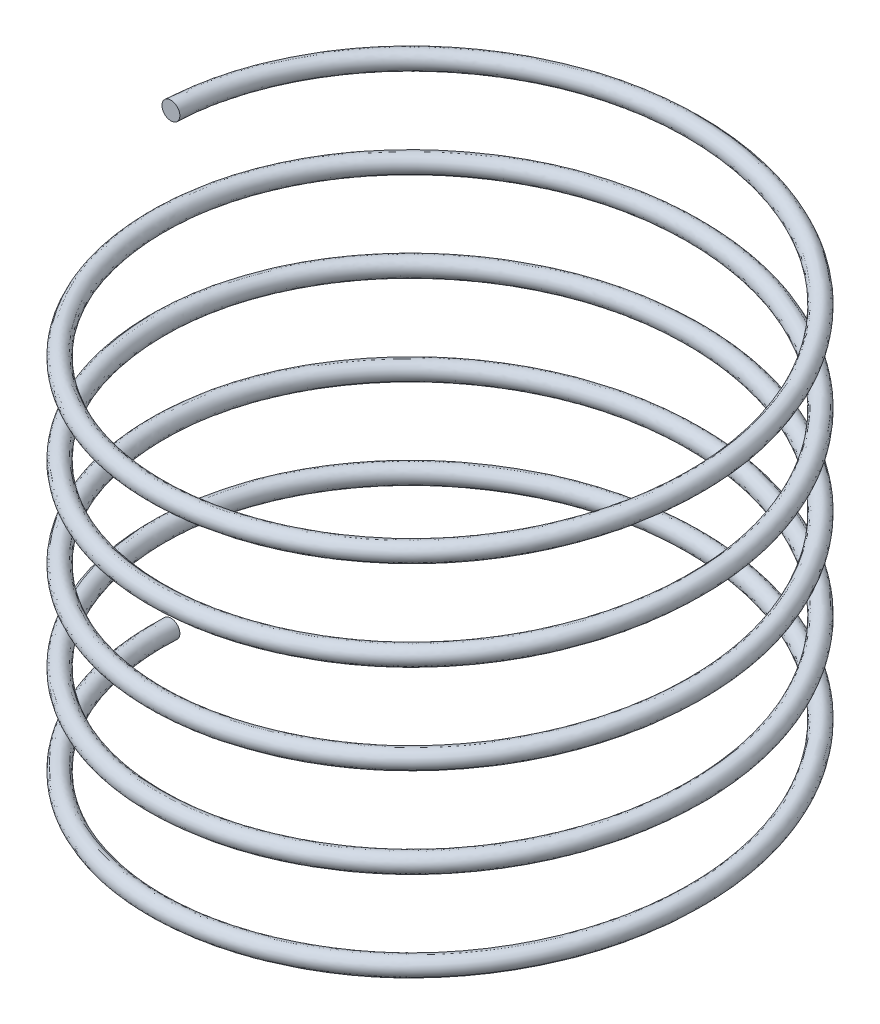
ISO-10303-21;
HEADER;
FILE_DESCRIPTION(('STEP AP214'),'2;1');
FILE_NAME('part.step','',(''),(''),'','','');
FILE_SCHEMA(('AUTOMOTIVE_DESIGN { 1 0 10303 214 1 1 1 1 }'));
ENDSEC;
DATA;
#1=APPLICATION_CONTEXT('core data for automotive mechanical design processes');
#2=APPLICATION_PROTOCOL_DEFINITION('international standard','automotive_design',2000,#1);
#3=PRODUCT_CONTEXT('',#1,'mechanical');
#4=PRODUCT('Part','Part','',(#3));
#5=PRODUCT_RELATED_PRODUCT_CATEGORY('part','',(#4));
#6=PRODUCT_DEFINITION_FORMATION('','',#4);
#7=PRODUCT_DEFINITION_CONTEXT('part definition',#1,'design');
#8=PRODUCT_DEFINITION('design','',#6,#7);
#9=PRODUCT_DEFINITION_SHAPE('','',#8);
#10=(LENGTH_UNIT() NAMED_UNIT(*) SI_UNIT(.MILLI.,.METRE.));
#11=(NAMED_UNIT(*) PLANE_ANGLE_UNIT() SI_UNIT($,.RADIAN.));
#12=(NAMED_UNIT(*) SI_UNIT($,.STERADIAN.) SOLID_ANGLE_UNIT());
#13=UNCERTAINTY_MEASURE_WITH_UNIT(LENGTH_MEASURE(1.E-05),#10,'distance_accuracy_value','');
#14=(GEOMETRIC_REPRESENTATION_CONTEXT(3) GLOBAL_UNCERTAINTY_ASSIGNED_CONTEXT((#13)) GLOBAL_UNIT_ASSIGNED_CONTEXT((#10,
#11,#12)) REPRESENTATION_CONTEXT('',''));
#15=CARTESIAN_POINT('',(0.,0.,0.));
#16=DIRECTION('',(0.,0.,1.));
#17=DIRECTION('',(1.,0.,0.));
#18=AXIS2_PLACEMENT_3D('',#15,#16,#17);
#19=CARTESIAN_POINT('',(-3.,0.,0.));
#20=DIRECTION('',(0.,0.,1.));
#21=DIRECTION('',(1.,0.,0.));
#22=AXIS2_PLACEMENT_3D('',#19,#20,#21);
#23=PLANE('',#22);
#24=CARTESIAN_POINT('',(-3.,0.,0.));
#25=DIRECTION('',(0.,0.,1.));
#26=DIRECTION('',(1.,0.,0.));
#27=AXIS2_PLACEMENT_3D('',#24,#25,#26);
#28=CIRCLE('',#27,0.0999999999999999);
#29=CARTESIAN_POINT('',(-2.9,0.,0.));
#30=VERTEX_POINT('',#29);
#31=EDGE_CURVE('E39',#30,#30,#28,.T.);
#32=ORIENTED_EDGE('',*,*,#31,.F.);
#33=EDGE_LOOP('',(#32));
#34=FACE_BOUND('',#33,.T.);
#35=ADVANCED_FACE('F32',(#34),#23,.F.);
#36=CARTESIAN_POINT('',(-3.,5.,2.09488880330588E-13));
#37=DIRECTION('',(0.,0.,1.));
#38=DIRECTION('',(1.,0.,0.));
#39=AXIS2_PLACEMENT_3D('',#36,#37,#38);
#40=PLANE('',#39);
#41=CARTESIAN_POINT('',(-3.,5.,2.09488880330588E-13));
#42=DIRECTION('',(0.,0.,1.));
#43=DIRECTION('',(1.,0.,0.));
#44=AXIS2_PLACEMENT_3D('',#41,#42,#43);
#45=CIRCLE('',#44,0.0999999999999999);
#46=CARTESIAN_POINT('',(-2.9,5.,2.02505917652902E-13));
#47=VERTEX_POINT('',#46);
#48=EDGE_CURVE('E11',#47,#47,#45,.T.);
#49=ORIENTED_EDGE('',*,*,#48,.T.);
#50=EDGE_LOOP('',(#49));
#51=FACE_BOUND('',#50,.T.);
#52=ADVANCED_FACE('F46',(#51),#40,.T.);
#53=CARTESIAN_POINT('',(-2.9,0.,0.));
#54=CARTESIAN_POINT('',(-2.9,0.0833333333333331,1.67431578064991));
#55=CARTESIAN_POINT('',(-1.45,0.166666666666666,2.51147367097487));
#56=CARTESIAN_POINT('',(0.,0.249999999999999,3.34863156129983));
#57=CARTESIAN_POINT('',(1.45,0.333333333333333,2.51147367097487));
#58=CARTESIAN_POINT('',(2.9,0.416666666666666,1.67431578064992));
#59=CARTESIAN_POINT('',(2.9,0.499999999999999,0.));
#60=CARTESIAN_POINT('',(2.9,0.583333333333332,-1.67431578064991));
#61=CARTESIAN_POINT('',(1.45,0.666666666666665,-2.51147367097487));
#62=CARTESIAN_POINT('',(0.,0.749999999999998,-3.34863156129983));
#63=CARTESIAN_POINT('',(-1.45,0.833333333333331,-2.51147367097487));
#64=CARTESIAN_POINT('',(-2.9,0.916666666666665,-1.67431578064992));
#65=CARTESIAN_POINT('',(-2.9,0.999999999999998,0.));
#66=CARTESIAN_POINT('',(-2.9,1.08333333333333,1.67431578064991));
#67=CARTESIAN_POINT('',(-1.45,1.16666666666666,2.51147367097487));
#68=CARTESIAN_POINT('',(0.,1.25,3.34863156129983));
#69=CARTESIAN_POINT('',(1.45,1.33333333333333,2.51147367097487));
#70=CARTESIAN_POINT('',(2.9,1.41666666666666,1.67431578064992));
#71=CARTESIAN_POINT('',(2.9,1.5,0.));
#72=CARTESIAN_POINT('',(2.9,1.58333333333333,-1.67431578064991));
#73=CARTESIAN_POINT('',(1.45,1.66666666666666,-2.51147367097487));
#74=CARTESIAN_POINT('',(0.,1.75,-3.34863156129983));
#75=CARTESIAN_POINT('',(-1.45,1.83333333333333,-2.51147367097487));
#76=CARTESIAN_POINT('',(-2.9,1.91666666666666,-1.67431578064992));
#77=CARTESIAN_POINT('',(-2.9,2.,0.));
#78=CARTESIAN_POINT('',(-2.9,2.08333333333333,1.67431578064991));
#79=CARTESIAN_POINT('',(-1.45,2.16666666666666,2.51147367097487));
#80=CARTESIAN_POINT('',(0.,2.24999999999999,3.34863156129983));
#81=CARTESIAN_POINT('',(1.45,2.33333333333333,2.51147367097487));
#82=CARTESIAN_POINT('',(2.9,2.41666666666666,1.67431578064992));
#83=CARTESIAN_POINT('',(2.9,2.49999999999999,0.));
#84=CARTESIAN_POINT('',(2.9,2.58333333333333,-1.67431578064991));
#85=CARTESIAN_POINT('',(1.45,2.66666666666666,-2.51147367097487));
#86=CARTESIAN_POINT('',(0.,2.74999999999999,-3.34863156129983));
#87=CARTESIAN_POINT('',(-1.45,2.83333333333333,-2.51147367097487));
#88=CARTESIAN_POINT('',(-2.9,2.91666666666666,-1.67431578064992));
#89=CARTESIAN_POINT('',(-2.9,2.99999999999999,0.));
#90=CARTESIAN_POINT('',(-2.9,3.08333333333333,1.67431578064991));
#91=CARTESIAN_POINT('',(-1.45,3.16666666666666,2.51147367097487));
#92=CARTESIAN_POINT('',(0.,3.24999999999999,3.34863156129983));
#93=CARTESIAN_POINT('',(1.45,3.33333333333333,2.51147367097487));
#94=CARTESIAN_POINT('',(2.9,3.41666666666666,1.67431578064992));
#95=CARTESIAN_POINT('',(2.9,3.49999999999999,0.));
#96=CARTESIAN_POINT('',(2.9,3.58333333333333,-1.67431578064991));
#97=CARTESIAN_POINT('',(1.45,3.66666666666666,-2.51147367097487));
#98=CARTESIAN_POINT('',(0.,3.74999999999999,-3.34863156129983));
#99=CARTESIAN_POINT('',(-1.45,3.83333333333332,-2.51147367097487));
#100=CARTESIAN_POINT('',(-2.9,3.91666666666666,-1.67431578064992));
#101=CARTESIAN_POINT('',(-2.9,3.99999999999999,0.));
#102=CARTESIAN_POINT('',(-2.9,4.08333333333332,1.67431578064991));
#103=CARTESIAN_POINT('',(-1.45,4.16666666666666,2.51147367097487));
#104=CARTESIAN_POINT('',(0.,4.24999999999999,3.34863156129983));
#105=CARTESIAN_POINT('',(1.45,4.33333333333332,2.51147367097487));
#106=CARTESIAN_POINT('',(2.9,4.41666666666666,1.67431578064992));
#107=CARTESIAN_POINT('',(2.9,4.49999999999999,0.));
#108=CARTESIAN_POINT('',(2.9,4.58333333333332,-1.67431578064991));
#109=CARTESIAN_POINT('',(1.45,4.66666666666666,-2.51147367097487));
#110=CARTESIAN_POINT('',(0.,4.74999999999999,-3.34863156129983));
#111=CARTESIAN_POINT('',(-1.45,4.83333333333332,-2.51147367097487));
#112=CARTESIAN_POINT('',(-2.9,4.91666666666666,-1.67431578064992));
#113=CARTESIAN_POINT('',(-2.9,4.99999999999999,0.));
#114=CARTESIAN_POINT('',(-2.9,0.2,0.));
#115=CARTESIAN_POINT('',(-2.9,0.283333333333333,1.67431578064991));
#116=CARTESIAN_POINT('',(-1.45,0.366666666666666,2.51147367097487));
#117=CARTESIAN_POINT('',(0.,0.449999999999999,3.34863156129983));
#118=CARTESIAN_POINT('',(1.45,0.533333333333332,2.51147367097487));
#119=CARTESIAN_POINT('',(2.9,0.616666666666666,1.67431578064992));
#120=CARTESIAN_POINT('',(2.9,0.699999999999999,0.));
#121=CARTESIAN_POINT('',(2.9,0.783333333333332,-1.67431578064991));
#122=CARTESIAN_POINT('',(1.45,0.866666666666665,-2.51147367097487));
#123=CARTESIAN_POINT('',(0.,0.949999999999998,-3.34863156129983));
#124=CARTESIAN_POINT('',(-1.45,1.03333333333333,-2.51147367097487));
#125=CARTESIAN_POINT('',(-2.9,1.11666666666666,-1.67431578064992));
#126=CARTESIAN_POINT('',(-2.9,1.2,0.));
#127=CARTESIAN_POINT('',(-2.9,1.28333333333333,1.67431578064991));
#128=CARTESIAN_POINT('',(-1.45,1.36666666666666,2.51147367097487));
#129=CARTESIAN_POINT('',(0.,1.45,3.34863156129983));
#130=CARTESIAN_POINT('',(1.45,1.53333333333333,2.51147367097487));
#131=CARTESIAN_POINT('',(2.9,1.61666666666666,1.67431578064992));
#132=CARTESIAN_POINT('',(2.9,1.7,0.));
#133=CARTESIAN_POINT('',(2.9,1.78333333333333,-1.67431578064991));
#134=CARTESIAN_POINT('',(1.45,1.86666666666666,-2.51147367097487));
#135=CARTESIAN_POINT('',(0.,1.95,-3.34863156129983));
#136=CARTESIAN_POINT('',(-1.45,2.03333333333333,-2.51147367097487));
#137=CARTESIAN_POINT('',(-2.9,2.11666666666666,-1.67431578064992));
#138=CARTESIAN_POINT('',(-2.9,2.19999999999999,0.));
#139=CARTESIAN_POINT('',(-2.9,2.28333333333333,1.67431578064991));
#140=CARTESIAN_POINT('',(-1.45,2.36666666666666,2.51147367097487));
#141=CARTESIAN_POINT('',(0.,2.44999999999999,3.34863156129983));
#142=CARTESIAN_POINT('',(1.45,2.53333333333333,2.51147367097487));
#143=CARTESIAN_POINT('',(2.9,2.61666666666666,1.67431578064992));
#144=CARTESIAN_POINT('',(2.9,2.69999999999999,0.));
#145=CARTESIAN_POINT('',(2.9,2.78333333333333,-1.67431578064991));
#146=CARTESIAN_POINT('',(1.45,2.86666666666666,-2.51147367097487));
#147=CARTESIAN_POINT('',(0.,2.94999999999999,-3.34863156129983));
#148=CARTESIAN_POINT('',(-1.45,3.03333333333333,-2.51147367097487));
#149=CARTESIAN_POINT('',(-2.9,3.11666666666666,-1.67431578064992));
#150=CARTESIAN_POINT('',(-2.9,3.19999999999999,0.));
#151=CARTESIAN_POINT('',(-2.9,3.28333333333333,1.67431578064991));
#152=CARTESIAN_POINT('',(-1.45,3.36666666666666,2.51147367097487));
#153=CARTESIAN_POINT('',(0.,3.44999999999999,3.34863156129983));
#154=CARTESIAN_POINT('',(1.45,3.53333333333333,2.51147367097487));
#155=CARTESIAN_POINT('',(2.9,3.61666666666666,1.67431578064992));
#156=CARTESIAN_POINT('',(2.9,3.69999999999999,0.));
#157=CARTESIAN_POINT('',(2.9,3.78333333333333,-1.67431578064991));
#158=CARTESIAN_POINT('',(1.45,3.86666666666666,-2.51147367097487));
#159=CARTESIAN_POINT('',(0.,3.94999999999999,-3.34863156129983));
#160=CARTESIAN_POINT('',(-1.45,4.03333333333332,-2.51147367097487));
#161=CARTESIAN_POINT('',(-2.9,4.11666666666666,-1.67431578064992));
#162=CARTESIAN_POINT('',(-2.9,4.19999999999999,0.));
#163=CARTESIAN_POINT('',(-2.9,4.28333333333332,1.67431578064991));
#164=CARTESIAN_POINT('',(-1.45,4.36666666666666,2.51147367097487));
#165=CARTESIAN_POINT('',(0.,4.44999999999999,3.34863156129983));
#166=CARTESIAN_POINT('',(1.45,4.53333333333332,2.51147367097487));
#167=CARTESIAN_POINT('',(2.9,4.61666666666666,1.67431578064992));
#168=CARTESIAN_POINT('',(2.9,4.69999999999999,0.));
#169=CARTESIAN_POINT('',(2.9,4.78333333333332,-1.67431578064991));
#170=CARTESIAN_POINT('',(1.45,4.86666666666666,-2.51147367097487));
#171=CARTESIAN_POINT('',(0.,4.94999999999999,-3.34863156129983));
#172=CARTESIAN_POINT('',(-1.45,5.03333333333332,-2.51147367097487));
#173=CARTESIAN_POINT('',(-2.9,5.11666666666665,-1.67431578064992));
#174=CARTESIAN_POINT('',(-2.9,5.19999999999999,0.));
#175=CARTESIAN_POINT('',(-3.1,0.2,0.));
#176=CARTESIAN_POINT('',(-3.1,0.283333333333333,1.78978583448784));
#177=CARTESIAN_POINT('',(-1.55,0.366666666666666,2.68467875173176));
#178=CARTESIAN_POINT('',(0.,0.449999999999999,3.57957166897568));
#179=CARTESIAN_POINT('',(1.55,0.533333333333332,2.68467875173176));
#180=CARTESIAN_POINT('',(3.1,0.616666666666666,1.78978583448784));
#181=CARTESIAN_POINT('',(3.1,0.699999999999999,0.));
#182=CARTESIAN_POINT('',(3.1,0.783333333333332,-1.78978583448784));
#183=CARTESIAN_POINT('',(1.55,0.866666666666665,-2.68467875173176));
#184=CARTESIAN_POINT('',(0.,0.949999999999998,-3.57957166897568));
#185=CARTESIAN_POINT('',(-1.55,1.03333333333333,-2.68467875173176));
#186=CARTESIAN_POINT('',(-3.1,1.11666666666666,-1.78978583448784));
#187=CARTESIAN_POINT('',(-3.1,1.2,0.));
#188=CARTESIAN_POINT('',(-3.1,1.28333333333333,1.78978583448784));
#189=CARTESIAN_POINT('',(-1.55,1.36666666666666,2.68467875173176));
#190=CARTESIAN_POINT('',(0.,1.45,3.57957166897568));
#191=CARTESIAN_POINT('',(1.55,1.53333333333333,2.68467875173176));
#192=CARTESIAN_POINT('',(3.1,1.61666666666666,1.78978583448784));
#193=CARTESIAN_POINT('',(3.1,1.7,0.));
#194=CARTESIAN_POINT('',(3.1,1.78333333333333,-1.78978583448784));
#195=CARTESIAN_POINT('',(1.55,1.86666666666666,-2.68467875173176));
#196=CARTESIAN_POINT('',(0.,1.95,-3.57957166897568));
#197=CARTESIAN_POINT('',(-1.55,2.03333333333333,-2.68467875173176));
#198=CARTESIAN_POINT('',(-3.1,2.11666666666666,-1.78978583448784));
#199=CARTESIAN_POINT('',(-3.1,2.19999999999999,0.));
#200=CARTESIAN_POINT('',(-3.1,2.28333333333333,1.78978583448784));
#201=CARTESIAN_POINT('',(-1.55,2.36666666666666,2.68467875173176));
#202=CARTESIAN_POINT('',(0.,2.44999999999999,3.57957166897568));
#203=CARTESIAN_POINT('',(1.55,2.53333333333333,2.68467875173176));
#204=CARTESIAN_POINT('',(3.1,2.61666666666666,1.78978583448784));
#205=CARTESIAN_POINT('',(3.1,2.69999999999999,0.));
#206=CARTESIAN_POINT('',(3.1,2.78333333333333,-1.78978583448784));
#207=CARTESIAN_POINT('',(1.55,2.86666666666666,-2.68467875173176));
#208=CARTESIAN_POINT('',(0.,2.94999999999999,-3.57957166897568));
#209=CARTESIAN_POINT('',(-1.55,3.03333333333333,-2.68467875173176));
#210=CARTESIAN_POINT('',(-3.1,3.11666666666666,-1.78978583448784));
#211=CARTESIAN_POINT('',(-3.1,3.19999999999999,0.));
#212=CARTESIAN_POINT('',(-3.1,3.28333333333333,1.78978583448784));
#213=CARTESIAN_POINT('',(-1.55,3.36666666666666,2.68467875173176));
#214=CARTESIAN_POINT('',(0.,3.44999999999999,3.57957166897568));
#215=CARTESIAN_POINT('',(1.55,3.53333333333333,2.68467875173176));
#216=CARTESIAN_POINT('',(3.1,3.61666666666666,1.78978583448784));
#217=CARTESIAN_POINT('',(3.1,3.69999999999999,0.));
#218=CARTESIAN_POINT('',(3.1,3.78333333333333,-1.78978583448784));
#219=CARTESIAN_POINT('',(1.55,3.86666666666666,-2.68467875173176));
#220=CARTESIAN_POINT('',(0.,3.94999999999999,-3.57957166897568));
#221=CARTESIAN_POINT('',(-1.55,4.03333333333332,-2.68467875173176));
#222=CARTESIAN_POINT('',(-3.1,4.11666666666666,-1.78978583448784));
#223=CARTESIAN_POINT('',(-3.1,4.19999999999999,0.));
#224=CARTESIAN_POINT('',(-3.1,4.28333333333332,1.78978583448784));
#225=CARTESIAN_POINT('',(-1.55,4.36666666666666,2.68467875173176));
#226=CARTESIAN_POINT('',(0.,4.44999999999999,3.57957166897568));
#227=CARTESIAN_POINT('',(1.55,4.53333333333332,2.68467875173176));
#228=CARTESIAN_POINT('',(3.1,4.61666666666666,1.78978583448784));
#229=CARTESIAN_POINT('',(3.1,4.69999999999999,0.));
#230=CARTESIAN_POINT('',(3.1,4.78333333333332,-1.78978583448784));
#231=CARTESIAN_POINT('',(1.55,4.86666666666666,-2.68467875173176));
#232=CARTESIAN_POINT('',(0.,4.94999999999999,-3.57957166897568));
#233=CARTESIAN_POINT('',(-1.55,5.03333333333332,-2.68467875173176));
#234=CARTESIAN_POINT('',(-3.1,5.11666666666665,-1.78978583448784));
#235=CARTESIAN_POINT('',(-3.1,5.19999999999999,0.));
#236=CARTESIAN_POINT('',(-3.1,0.,0.));
#237=CARTESIAN_POINT('',(-3.1,0.0833333333333331,1.78978583448784));
#238=CARTESIAN_POINT('',(-1.55,0.166666666666666,2.68467875173176));
#239=CARTESIAN_POINT('',(0.,0.249999999999999,3.57957166897568));
#240=CARTESIAN_POINT('',(1.55,0.333333333333333,2.68467875173176));
#241=CARTESIAN_POINT('',(3.1,0.416666666666666,1.78978583448784));
#242=CARTESIAN_POINT('',(3.1,0.499999999999999,0.));
#243=CARTESIAN_POINT('',(3.1,0.583333333333332,-1.78978583448784));
#244=CARTESIAN_POINT('',(1.55,0.666666666666665,-2.68467875173176));
#245=CARTESIAN_POINT('',(0.,0.749999999999998,-3.57957166897568));
#246=CARTESIAN_POINT('',(-1.55,0.833333333333331,-2.68467875173176));
#247=CARTESIAN_POINT('',(-3.1,0.916666666666665,-1.78978583448784));
#248=CARTESIAN_POINT('',(-3.1,0.999999999999998,0.));
#249=CARTESIAN_POINT('',(-3.1,1.08333333333333,1.78978583448784));
#250=CARTESIAN_POINT('',(-1.55,1.16666666666666,2.68467875173176));
#251=CARTESIAN_POINT('',(0.,1.25,3.57957166897568));
#252=CARTESIAN_POINT('',(1.55,1.33333333333333,2.68467875173176));
#253=CARTESIAN_POINT('',(3.1,1.41666666666666,1.78978583448784));
#254=CARTESIAN_POINT('',(3.1,1.5,0.));
#255=CARTESIAN_POINT('',(3.1,1.58333333333333,-1.78978583448784));
#256=CARTESIAN_POINT('',(1.55,1.66666666666666,-2.68467875173176));
#257=CARTESIAN_POINT('',(0.,1.75,-3.57957166897568));
#258=CARTESIAN_POINT('',(-1.55,1.83333333333333,-2.68467875173176));
#259=CARTESIAN_POINT('',(-3.1,1.91666666666666,-1.78978583448784));
#260=CARTESIAN_POINT('',(-3.1,2.,0.));
#261=CARTESIAN_POINT('',(-3.1,2.08333333333333,1.78978583448784));
#262=CARTESIAN_POINT('',(-1.55,2.16666666666666,2.68467875173176));
#263=CARTESIAN_POINT('',(0.,2.24999999999999,3.57957166897568));
#264=CARTESIAN_POINT('',(1.55,2.33333333333333,2.68467875173176));
#265=CARTESIAN_POINT('',(3.1,2.41666666666666,1.78978583448784));
#266=CARTESIAN_POINT('',(3.1,2.49999999999999,0.));
#267=CARTESIAN_POINT('',(3.1,2.58333333333333,-1.78978583448784));
#268=CARTESIAN_POINT('',(1.55,2.66666666666666,-2.68467875173176));
#269=CARTESIAN_POINT('',(0.,2.74999999999999,-3.57957166897568));
#270=CARTESIAN_POINT('',(-1.55,2.83333333333333,-2.68467875173176));
#271=CARTESIAN_POINT('',(-3.1,2.91666666666666,-1.78978583448784));
#272=CARTESIAN_POINT('',(-3.1,2.99999999999999,0.));
#273=CARTESIAN_POINT('',(-3.1,3.08333333333333,1.78978583448784));
#274=CARTESIAN_POINT('',(-1.55,3.16666666666666,2.68467875173176));
#275=CARTESIAN_POINT('',(0.,3.24999999999999,3.57957166897568));
#276=CARTESIAN_POINT('',(1.55,3.33333333333333,2.68467875173176));
#277=CARTESIAN_POINT('',(3.1,3.41666666666666,1.78978583448784));
#278=CARTESIAN_POINT('',(3.1,3.49999999999999,0.));
#279=CARTESIAN_POINT('',(3.1,3.58333333333333,-1.78978583448784));
#280=CARTESIAN_POINT('',(1.55,3.66666666666666,-2.68467875173176));
#281=CARTESIAN_POINT('',(0.,3.74999999999999,-3.57957166897568));
#282=CARTESIAN_POINT('',(-1.55,3.83333333333332,-2.68467875173176));
#283=CARTESIAN_POINT('',(-3.1,3.91666666666666,-1.78978583448784));
#284=CARTESIAN_POINT('',(-3.1,3.99999999999999,0.));
#285=CARTESIAN_POINT('',(-3.1,4.08333333333332,1.78978583448784));
#286=CARTESIAN_POINT('',(-1.55,4.16666666666666,2.68467875173176));
#287=CARTESIAN_POINT('',(0.,4.24999999999999,3.57957166897568));
#288=CARTESIAN_POINT('',(1.55,4.33333333333332,2.68467875173176));
#289=CARTESIAN_POINT('',(3.1,4.41666666666666,1.78978583448784));
#290=CARTESIAN_POINT('',(3.1,4.49999999999999,0.));
#291=CARTESIAN_POINT('',(3.1,4.58333333333332,-1.78978583448784));
#292=CARTESIAN_POINT('',(1.55,4.66666666666666,-2.68467875173176));
#293=CARTESIAN_POINT('',(0.,4.74999999999999,-3.57957166897568));
#294=CARTESIAN_POINT('',(-1.55,4.83333333333332,-2.68467875173176));
#295=CARTESIAN_POINT('',(-3.1,4.91666666666666,-1.78978583448784));
#296=CARTESIAN_POINT('',(-3.1,4.99999999999999,0.));
#297=CARTESIAN_POINT('',(-3.1,-0.2,0.));
#298=CARTESIAN_POINT('',(-3.1,-0.116666666666667,1.78978583448784));
#299=CARTESIAN_POINT('',(-1.55,-0.0333333333333335,2.68467875173176));
#300=CARTESIAN_POINT('',(0.,0.0499999999999997,3.57957166897568));
#301=CARTESIAN_POINT('',(1.55,0.133333333333333,2.68467875173176));
#302=CARTESIAN_POINT('',(3.1,0.216666666666666,1.78978583448784));
#303=CARTESIAN_POINT('',(3.1,0.299999999999999,0.));
#304=CARTESIAN_POINT('',(3.1,0.383333333333332,-1.78978583448784));
#305=CARTESIAN_POINT('',(1.55,0.466666666666665,-2.68467875173176));
#306=CARTESIAN_POINT('',(0.,0.549999999999998,-3.57957166897568));
#307=CARTESIAN_POINT('',(-1.55,0.633333333333332,-2.68467875173176));
#308=CARTESIAN_POINT('',(-3.1,0.716666666666665,-1.78978583448784));
#309=CARTESIAN_POINT('',(-3.1,0.799999999999998,0.));
#310=CARTESIAN_POINT('',(-3.1,0.883333333333331,1.78978583448784));
#311=CARTESIAN_POINT('',(-1.55,0.966666666666664,2.68467875173176));
#312=CARTESIAN_POINT('',(0.,1.05,3.57957166897568));
#313=CARTESIAN_POINT('',(1.55,1.13333333333333,2.68467875173176));
#314=CARTESIAN_POINT('',(3.1,1.21666666666666,1.78978583448784));
#315=CARTESIAN_POINT('',(3.1,1.3,0.));
#316=CARTESIAN_POINT('',(3.1,1.38333333333333,-1.78978583448784));
#317=CARTESIAN_POINT('',(1.55,1.46666666666666,-2.68467875173176));
#318=CARTESIAN_POINT('',(0.,1.55,-3.57957166897568));
#319=CARTESIAN_POINT('',(-1.55,1.63333333333333,-2.68467875173176));
#320=CARTESIAN_POINT('',(-3.1,1.71666666666666,-1.78978583448784));
#321=CARTESIAN_POINT('',(-3.1,1.8,0.));
#322=CARTESIAN_POINT('',(-3.1,1.88333333333333,1.78978583448784));
#323=CARTESIAN_POINT('',(-1.55,1.96666666666666,2.68467875173176));
#324=CARTESIAN_POINT('',(0.,2.04999999999999,3.57957166897568));
#325=CARTESIAN_POINT('',(1.55,2.13333333333333,2.68467875173176));
#326=CARTESIAN_POINT('',(3.1,2.21666666666666,1.78978583448784));
#327=CARTESIAN_POINT('',(3.1,2.29999999999999,0.));
#328=CARTESIAN_POINT('',(3.1,2.38333333333333,-1.78978583448784));
#329=CARTESIAN_POINT('',(1.55,2.46666666666666,-2.68467875173176));
#330=CARTESIAN_POINT('',(0.,2.54999999999999,-3.57957166897568));
#331=CARTESIAN_POINT('',(-1.55,2.63333333333333,-2.68467875173176));
#332=CARTESIAN_POINT('',(-3.1,2.71666666666666,-1.78978583448784));
#333=CARTESIAN_POINT('',(-3.1,2.79999999999999,0.));
#334=CARTESIAN_POINT('',(-3.1,2.88333333333333,1.78978583448784));
#335=CARTESIAN_POINT('',(-1.55,2.96666666666666,2.68467875173176));
#336=CARTESIAN_POINT('',(0.,3.04999999999999,3.57957166897568));
#337=CARTESIAN_POINT('',(1.55,3.13333333333333,2.68467875173176));
#338=CARTESIAN_POINT('',(3.1,3.21666666666666,1.78978583448784));
#339=CARTESIAN_POINT('',(3.1,3.29999999999999,0.));
#340=CARTESIAN_POINT('',(3.1,3.38333333333333,-1.78978583448784));
#341=CARTESIAN_POINT('',(1.55,3.46666666666666,-2.68467875173176));
#342=CARTESIAN_POINT('',(0.,3.54999999999999,-3.57957166897568));
#343=CARTESIAN_POINT('',(-1.55,3.63333333333332,-2.68467875173176));
#344=CARTESIAN_POINT('',(-3.1,3.71666666666666,-1.78978583448784));
#345=CARTESIAN_POINT('',(-3.1,3.79999999999999,0.));
#346=CARTESIAN_POINT('',(-3.1,3.88333333333332,1.78978583448784));
#347=CARTESIAN_POINT('',(-1.55,3.96666666666666,2.68467875173176));
#348=CARTESIAN_POINT('',(0.,4.04999999999999,3.57957166897568));
#349=CARTESIAN_POINT('',(1.55,4.13333333333332,2.68467875173176));
#350=CARTESIAN_POINT('',(3.1,4.21666666666666,1.78978583448784));
#351=CARTESIAN_POINT('',(3.1,4.29999999999999,0.));
#352=CARTESIAN_POINT('',(3.1,4.38333333333332,-1.78978583448784));
#353=CARTESIAN_POINT('',(1.55,4.46666666666666,-2.68467875173176));
#354=CARTESIAN_POINT('',(0.,4.54999999999999,-3.57957166897568));
#355=CARTESIAN_POINT('',(-1.55,4.63333333333332,-2.68467875173176));
#356=CARTESIAN_POINT('',(-3.1,4.71666666666666,-1.78978583448784));
#357=CARTESIAN_POINT('',(-3.1,4.79999999999999,0.));
#358=CARTESIAN_POINT('',(-2.9,-0.2,0.));
#359=CARTESIAN_POINT('',(-2.9,-0.116666666666667,1.67431578064991));
#360=CARTESIAN_POINT('',(-1.45,-0.0333333333333335,2.51147367097487));
#361=CARTESIAN_POINT('',(0.,0.0499999999999997,3.34863156129983));
#362=CARTESIAN_POINT('',(1.45,0.133333333333333,2.51147367097487));
#363=CARTESIAN_POINT('',(2.9,0.216666666666666,1.67431578064992));
#364=CARTESIAN_POINT('',(2.9,0.299999999999999,0.));
#365=CARTESIAN_POINT('',(2.9,0.383333333333332,-1.67431578064991));
#366=CARTESIAN_POINT('',(1.45,0.466666666666665,-2.51147367097487));
#367=CARTESIAN_POINT('',(0.,0.549999999999998,-3.34863156129983));
#368=CARTESIAN_POINT('',(-1.45,0.633333333333332,-2.51147367097487));
#369=CARTESIAN_POINT('',(-2.9,0.716666666666665,-1.67431578064992));
#370=CARTESIAN_POINT('',(-2.9,0.799999999999998,0.));
#371=CARTESIAN_POINT('',(-2.9,0.883333333333331,1.67431578064991));
#372=CARTESIAN_POINT('',(-1.45,0.966666666666664,2.51147367097487));
#373=CARTESIAN_POINT('',(0.,1.05,3.34863156129983));
#374=CARTESIAN_POINT('',(1.45,1.13333333333333,2.51147367097487));
#375=CARTESIAN_POINT('',(2.9,1.21666666666666,1.67431578064992));
#376=CARTESIAN_POINT('',(2.9,1.3,0.));
#377=CARTESIAN_POINT('',(2.9,1.38333333333333,-1.67431578064991));
#378=CARTESIAN_POINT('',(1.45,1.46666666666666,-2.51147367097487));
#379=CARTESIAN_POINT('',(0.,1.55,-3.34863156129983));
#380=CARTESIAN_POINT('',(-1.45,1.63333333333333,-2.51147367097487));
#381=CARTESIAN_POINT('',(-2.9,1.71666666666666,-1.67431578064992));
#382=CARTESIAN_POINT('',(-2.9,1.8,0.));
#383=CARTESIAN_POINT('',(-2.9,1.88333333333333,1.67431578064991));
#384=CARTESIAN_POINT('',(-1.45,1.96666666666666,2.51147367097487));
#385=CARTESIAN_POINT('',(0.,2.04999999999999,3.34863156129983));
#386=CARTESIAN_POINT('',(1.45,2.13333333333333,2.51147367097487));
#387=CARTESIAN_POINT('',(2.9,2.21666666666666,1.67431578064992));
#388=CARTESIAN_POINT('',(2.9,2.29999999999999,0.));
#389=CARTESIAN_POINT('',(2.9,2.38333333333333,-1.67431578064991));
#390=CARTESIAN_POINT('',(1.45,2.46666666666666,-2.51147367097487));
#391=CARTESIAN_POINT('',(0.,2.54999999999999,-3.34863156129983));
#392=CARTESIAN_POINT('',(-1.45,2.63333333333333,-2.51147367097487));
#393=CARTESIAN_POINT('',(-2.9,2.71666666666666,-1.67431578064992));
#394=CARTESIAN_POINT('',(-2.9,2.79999999999999,0.));
#395=CARTESIAN_POINT('',(-2.9,2.88333333333333,1.67431578064991));
#396=CARTESIAN_POINT('',(-1.45,2.96666666666666,2.51147367097487));
#397=CARTESIAN_POINT('',(0.,3.04999999999999,3.34863156129983));
#398=CARTESIAN_POINT('',(1.45,3.13333333333333,2.51147367097487));
#399=CARTESIAN_POINT('',(2.9,3.21666666666666,1.67431578064992));
#400=CARTESIAN_POINT('',(2.9,3.29999999999999,0.));
#401=CARTESIAN_POINT('',(2.9,3.38333333333333,-1.67431578064991));
#402=CARTESIAN_POINT('',(1.45,3.46666666666666,-2.51147367097487));
#403=CARTESIAN_POINT('',(0.,3.54999999999999,-3.34863156129983));
#404=CARTESIAN_POINT('',(-1.45,3.63333333333332,-2.51147367097487));
#405=CARTESIAN_POINT('',(-2.9,3.71666666666666,-1.67431578064992));
#406=CARTESIAN_POINT('',(-2.9,3.79999999999999,0.));
#407=CARTESIAN_POINT('',(-2.9,3.88333333333332,1.67431578064991));
#408=CARTESIAN_POINT('',(-1.45,3.96666666666666,2.51147367097487));
#409=CARTESIAN_POINT('',(0.,4.04999999999999,3.34863156129983));
#410=CARTESIAN_POINT('',(1.45,4.13333333333332,2.51147367097487));
#411=CARTESIAN_POINT('',(2.9,4.21666666666666,1.67431578064992));
#412=CARTESIAN_POINT('',(2.9,4.29999999999999,0.));
#413=CARTESIAN_POINT('',(2.9,4.38333333333332,-1.67431578064991));
#414=CARTESIAN_POINT('',(1.45,4.46666666666666,-2.51147367097487));
#415=CARTESIAN_POINT('',(0.,4.54999999999999,-3.34863156129983));
#416=CARTESIAN_POINT('',(-1.45,4.63333333333332,-2.51147367097487));
#417=CARTESIAN_POINT('',(-2.9,4.71666666666666,-1.67431578064992));
#418=CARTESIAN_POINT('',(-2.9,4.79999999999999,0.));
#419=CARTESIAN_POINT('',(-2.9,0.,0.));
#420=CARTESIAN_POINT('',(-2.9,0.0833333333333331,1.67431578064991));
#421=CARTESIAN_POINT('',(-1.45,0.166666666666666,2.51147367097487));
#422=CARTESIAN_POINT('',(0.,0.249999999999999,3.34863156129983));
#423=CARTESIAN_POINT('',(1.45,0.333333333333333,2.51147367097487));
#424=CARTESIAN_POINT('',(2.9,0.416666666666666,1.67431578064992));
#425=CARTESIAN_POINT('',(2.9,0.499999999999999,0.));
#426=CARTESIAN_POINT('',(2.9,0.583333333333332,-1.67431578064991));
#427=CARTESIAN_POINT('',(1.45,0.666666666666665,-2.51147367097487));
#428=CARTESIAN_POINT('',(0.,0.749999999999998,-3.34863156129983));
#429=CARTESIAN_POINT('',(-1.45,0.833333333333331,-2.51147367097487));
#430=CARTESIAN_POINT('',(-2.9,0.916666666666665,-1.67431578064992));
#431=CARTESIAN_POINT('',(-2.9,0.999999999999998,0.));
#432=CARTESIAN_POINT('',(-2.9,1.08333333333333,1.67431578064991));
#433=CARTESIAN_POINT('',(-1.45,1.16666666666666,2.51147367097487));
#434=CARTESIAN_POINT('',(0.,1.25,3.34863156129983));
#435=CARTESIAN_POINT('',(1.45,1.33333333333333,2.51147367097487));
#436=CARTESIAN_POINT('',(2.9,1.41666666666666,1.67431578064992));
#437=CARTESIAN_POINT('',(2.9,1.5,0.));
#438=CARTESIAN_POINT('',(2.9,1.58333333333333,-1.67431578064991));
#439=CARTESIAN_POINT('',(1.45,1.66666666666666,-2.51147367097487));
#440=CARTESIAN_POINT('',(0.,1.75,-3.34863156129983));
#441=CARTESIAN_POINT('',(-1.45,1.83333333333333,-2.51147367097487));
#442=CARTESIAN_POINT('',(-2.9,1.91666666666666,-1.67431578064992));
#443=CARTESIAN_POINT('',(-2.9,2.,0.));
#444=CARTESIAN_POINT('',(-2.9,2.08333333333333,1.67431578064991));
#445=CARTESIAN_POINT('',(-1.45,2.16666666666666,2.51147367097487));
#446=CARTESIAN_POINT('',(0.,2.24999999999999,3.34863156129983));
#447=CARTESIAN_POINT('',(1.45,2.33333333333333,2.51147367097487));
#448=CARTESIAN_POINT('',(2.9,2.41666666666666,1.67431578064992));
#449=CARTESIAN_POINT('',(2.9,2.49999999999999,0.));
#450=CARTESIAN_POINT('',(2.9,2.58333333333333,-1.67431578064991));
#451=CARTESIAN_POINT('',(1.45,2.66666666666666,-2.51147367097487));
#452=CARTESIAN_POINT('',(0.,2.74999999999999,-3.34863156129983));
#453=CARTESIAN_POINT('',(-1.45,2.83333333333333,-2.51147367097487));
#454=CARTESIAN_POINT('',(-2.9,2.91666666666666,-1.67431578064992));
#455=CARTESIAN_POINT('',(-2.9,2.99999999999999,0.));
#456=CARTESIAN_POINT('',(-2.9,3.08333333333333,1.67431578064991));
#457=CARTESIAN_POINT('',(-1.45,3.16666666666666,2.51147367097487));
#458=CARTESIAN_POINT('',(0.,3.24999999999999,3.34863156129983));
#459=CARTESIAN_POINT('',(1.45,3.33333333333333,2.51147367097487));
#460=CARTESIAN_POINT('',(2.9,3.41666666666666,1.67431578064992));
#461=CARTESIAN_POINT('',(2.9,3.49999999999999,0.));
#462=CARTESIAN_POINT('',(2.9,3.58333333333333,-1.67431578064991));
#463=CARTESIAN_POINT('',(1.45,3.66666666666666,-2.51147367097487));
#464=CARTESIAN_POINT('',(0.,3.74999999999999,-3.34863156129983));
#465=CARTESIAN_POINT('',(-1.45,3.83333333333332,-2.51147367097487));
#466=CARTESIAN_POINT('',(-2.9,3.91666666666666,-1.67431578064992));
#467=CARTESIAN_POINT('',(-2.9,3.99999999999999,0.));
#468=CARTESIAN_POINT('',(-2.9,4.08333333333332,1.67431578064991));
#469=CARTESIAN_POINT('',(-1.45,4.16666666666666,2.51147367097487));
#470=CARTESIAN_POINT('',(0.,4.24999999999999,3.34863156129983));
#471=CARTESIAN_POINT('',(1.45,4.33333333333332,2.51147367097487));
#472=CARTESIAN_POINT('',(2.9,4.41666666666666,1.67431578064992));
#473=CARTESIAN_POINT('',(2.9,4.49999999999999,0.));
#474=CARTESIAN_POINT('',(2.9,4.58333333333332,-1.67431578064991));
#475=CARTESIAN_POINT('',(1.45,4.66666666666666,-2.51147367097487));
#476=CARTESIAN_POINT('',(0.,4.74999999999999,-3.34863156129983));
#477=CARTESIAN_POINT('',(-1.45,4.83333333333332,-2.51147367097487));
#478=CARTESIAN_POINT('',(-2.9,4.91666666666666,-1.67431578064992));
#479=CARTESIAN_POINT('',(-2.9,4.99999999999999,0.));
#480=(BOUNDED_SURFACE() B_SPLINE_SURFACE(3,2,((#53,#54,#55,#56,#57,#58,#59,#60,#61,#62,#63,#64,
#65,#66,#67,#68,#69,#70,#71,#72,#73,#74,#75,#76,#77,#78,#79,#80,#81,#82,#83,#84,#85,#86,#87,#88,
#89,#90,#91,#92,#93,#94,#95,#96,#97,#98,#99,#100,#101,#102,#103,#104,#105,#106,#107,#108,#109,
#110,#111,#112,#113),(#114,#115,#116,#117,#118,#119,#120,#121,#122,#123,#124,#125,#126,#127,
#128,#129,#130,#131,#132,#133,#134,#135,#136,#137,#138,#139,#140,#141,#142,#143,#144,#145,#146,
#147,#148,#149,#150,#151,#152,#153,#154,#155,#156,#157,#158,#159,#160,#161,#162,#163,#164,#165,
#166,#167,#168,#169,#170,#171,#172,#173,#174),(#175,#176,#177,#178,#179,#180,#181,#182,#183,
#184,#185,#186,#187,#188,#189,#190,#191,#192,#193,#194,#195,#196,#197,#198,#199,#200,#201,#202,
#203,#204,#205,#206,#207,#208,#209,#210,#211,#212,#213,#214,#215,#216,#217,#218,#219,#220,#221,
#222,#223,#224,#225,#226,#227,#228,#229,#230,#231,#232,#233,#234,#235),(#236,#237,#238,#239,
#240,#241,#242,#243,#244,#245,#246,#247,#248,#249,#250,#251,#252,#253,#254,#255,#256,#257,#258,
#259,#260,#261,#262,#263,#264,#265,#266,#267,#268,#269,#270,#271,#272,#273,#274,#275,#276,#277,
#278,#279,#280,#281,#282,#283,#284,#285,#286,#287,#288,#289,#290,#291,#292,#293,#294,#295,#296),
(#297,#298,#299,#300,#301,#302,#303,#304,#305,#306,#307,#308,#309,#310,#311,#312,#313,#314,#315,
#316,#317,#318,#319,#320,#321,#322,#323,#324,#325,#326,#327,#328,#329,#330,#331,#332,#333,#334,
#335,#336,#337,#338,#339,#340,#341,#342,#343,#344,#345,#346,#347,#348,#349,#350,#351,#352,#353,
#354,#355,#356,#357),(#358,#359,#360,#361,#362,#363,#364,#365,#366,#367,#368,#369,#370,#371,
#372,#373,#374,#375,#376,#377,#378,#379,#380,#381,#382,#383,#384,#385,#386,#387,#388,#389,#390,
#391,#392,#393,#394,#395,#396,#397,#398,#399,#400,#401,#402,#403,#404,#405,#406,#407,#408,#409,
#410,#411,#412,#413,#414,#415,#416,#417,#418),(#419,#420,#421,#422,#423,#424,#425,#426,#427,
#428,#429,#430,#431,#432,#433,#434,#435,#436,#437,#438,#439,#440,#441,#442,#443,#444,#445,#446,
#447,#448,#449,#450,#451,#452,#453,#454,#455,#456,#457,#458,#459,#460,#461,#462,#463,#464,#465,
#466,#467,#468,#469,#470,#471,#472,#473,#474,#475,#476,#477,#478,#479)),.UNSPECIFIED.,.T.,.F.,
.F.) B_SPLINE_SURFACE_WITH_KNOTS((4,3,4),(3,2,2,2,2,2,2,2,2,2,2,2,2,2,2,2,2,2,2,2,2,2,2,2,2,2,2,
2,2,2,3),(0.,0.5,1.),(0.,0.0333333333333333,0.0666666666666667,0.1,0.133333333333333,
0.166666666666667,0.2,0.233333333333333,0.266666666666667,0.3,0.333333333333333,
0.366666666666667,0.4,0.433333333333333,0.466666666666667,0.5,0.533333333333333,
0.566666666666667,0.6,0.633333333333333,0.666666666666667,0.7,0.733333333333333,
0.766666666666667,0.8,0.833333333333333,0.866666666666667,0.9,0.933333333333333,
0.966666666666667,1.),
.UNSPECIFIED.) GEOMETRIC_REPRESENTATION_ITEM() RATIONAL_B_SPLINE_SURFACE(((1.,0.866025403784439,
1.,0.866025403784439,1.,0.866025403784439,1.,0.866025403784439,1.,0.866025403784439,1.,
0.866025403784439,1.,0.866025403784439,1.,0.866025403784439,1.,0.866025403784439,1.,
0.866025403784439,1.,0.866025403784439,1.,0.866025403784439,1.,0.866025403784439,1.,
0.866025403784439,1.,0.866025403784439,1.,0.866025403784439,1.,0.866025403784439,1.,
0.866025403784439,1.,0.866025403784439,1.,0.866025403784439,1.,0.866025403784439,1.,
0.866025403784439,1.,0.866025403784439,1.,0.866025403784439,1.,0.866025403784439,1.,
0.866025403784439,1.,0.866025403784439,1.,0.866025403784439,1.,0.866025403784439,1.,
0.866025403784439,1.),(0.333333333333333,0.288675134594813,0.333333333333333,0.288675134594813,
0.333333333333333,0.288675134594813,0.333333333333333,0.288675134594813,0.333333333333333,
0.288675134594813,0.333333333333333,0.288675134594813,0.333333333333333,0.288675134594813,
0.333333333333333,0.288675134594813,0.333333333333333,0.288675134594813,0.333333333333333,
0.288675134594813,0.333333333333333,0.288675134594813,0.333333333333333,0.288675134594813,
0.333333333333333,0.288675134594813,0.333333333333333,0.288675134594813,0.333333333333333,
0.288675134594813,0.333333333333333,0.288675134594813,0.333333333333333,0.288675134594813,
0.333333333333333,0.288675134594813,0.333333333333333,0.288675134594813,0.333333333333333,
0.288675134594813,0.333333333333333,0.288675134594813,0.333333333333333,0.288675134594813,
0.333333333333333,0.288675134594813,0.333333333333333,0.288675134594813,0.333333333333333,
0.288675134594813,0.333333333333333,0.288675134594813,0.333333333333333,0.288675134594813,
0.333333333333333,0.288675134594813,0.333333333333333,0.288675134594813,0.333333333333333,
0.288675134594813,0.333333333333333),(0.333333333333333,0.288675134594813,0.333333333333333,
0.288675134594813,0.333333333333333,0.288675134594813,0.333333333333333,0.288675134594813,
0.333333333333333,0.288675134594813,0.333333333333333,0.288675134594813,0.333333333333333,
0.288675134594813,0.333333333333333,0.288675134594813,0.333333333333333,0.288675134594813,
0.333333333333333,0.288675134594813,0.333333333333333,0.288675134594813,0.333333333333333,
0.288675134594813,0.333333333333333,0.288675134594813,0.333333333333333,0.288675134594813,
0.333333333333333,0.288675134594813,0.333333333333333,0.288675134594813,0.333333333333333,
0.288675134594813,0.333333333333333,0.288675134594813,0.333333333333333,0.288675134594813,
0.333333333333333,0.288675134594813,0.333333333333333,0.288675134594813,0.333333333333333,
0.288675134594813,0.333333333333333,0.288675134594813,0.333333333333333,0.288675134594813,
0.333333333333333,0.288675134594813,0.333333333333333,0.288675134594813,0.333333333333333,
0.288675134594813,0.333333333333333,0.288675134594813,0.333333333333333,0.288675134594813,
0.333333333333333,0.288675134594813,0.333333333333333),(1.,0.866025403784439,1.,
0.866025403784439,1.,0.866025403784439,1.,0.866025403784439,1.,0.866025403784439,1.,
0.866025403784439,1.,0.866025403784439,1.,0.866025403784439,1.,0.866025403784439,1.,
0.866025403784439,1.,0.866025403784439,1.,0.866025403784439,1.,0.866025403784439,1.,
0.866025403784439,1.,0.866025403784439,1.,0.866025403784439,1.,0.866025403784439,1.,
0.866025403784439,1.,0.866025403784439,1.,0.866025403784439,1.,0.866025403784439,1.,
0.866025403784439,1.,0.866025403784439,1.,0.866025403784439,1.,0.866025403784439,1.,
0.866025403784439,1.,0.866025403784439,1.,0.866025403784439,1.,0.866025403784439,1.,
0.866025403784439,1.),(0.333333333333333,0.288675134594813,0.333333333333333,0.288675134594813,
0.333333333333333,0.288675134594813,0.333333333333333,0.288675134594813,0.333333333333333,
0.288675134594813,0.333333333333333,0.288675134594813,0.333333333333333,0.288675134594813,
0.333333333333333,0.288675134594813,0.333333333333333,0.288675134594813,0.333333333333333,
0.288675134594813,0.333333333333333,0.288675134594813,0.333333333333333,0.288675134594813,
0.333333333333333,0.288675134594813,0.333333333333333,0.288675134594813,0.333333333333333,
0.288675134594813,0.333333333333333,0.288675134594813,0.333333333333333,0.288675134594813,
0.333333333333333,0.288675134594813,0.333333333333333,0.288675134594813,0.333333333333333,
0.288675134594813,0.333333333333333,0.288675134594813,0.333333333333333,0.288675134594813,
0.333333333333333,0.288675134594813,0.333333333333333,0.288675134594813,0.333333333333333,
0.288675134594813,0.333333333333333,0.288675134594813,0.333333333333333,0.288675134594813,
0.333333333333333,0.288675134594813,0.333333333333333,0.288675134594813,0.333333333333333,
0.288675134594813,0.333333333333333),(0.333333333333333,0.288675134594813,0.333333333333333,
0.288675134594813,0.333333333333333,0.288675134594813,0.333333333333333,0.288675134594813,
0.333333333333333,0.288675134594813,0.333333333333333,0.288675134594813,0.333333333333333,
0.288675134594813,0.333333333333333,0.288675134594813,0.333333333333333,0.288675134594813,
0.333333333333333,0.288675134594813,0.333333333333333,0.288675134594813,0.333333333333333,
0.288675134594813,0.333333333333333,0.288675134594813,0.333333333333333,0.288675134594813,
0.333333333333333,0.288675134594813,0.333333333333333,0.288675134594813,0.333333333333333,
0.288675134594813,0.333333333333333,0.288675134594813,0.333333333333333,0.288675134594813,
0.333333333333333,0.288675134594813,0.333333333333333,0.288675134594813,0.333333333333333,
0.288675134594813,0.333333333333333,0.288675134594813,0.333333333333333,0.288675134594813,
0.333333333333333,0.288675134594813,0.333333333333333,0.288675134594813,0.333333333333333,
0.288675134594813,0.333333333333333,0.288675134594813,0.333333333333333,0.288675134594813,
0.333333333333333,0.288675134594813,0.333333333333333),(1.,0.866025403784439,1.,
0.866025403784439,1.,0.866025403784439,1.,0.866025403784439,1.,0.866025403784439,1.,
0.866025403784439,1.,0.866025403784439,1.,0.866025403784439,1.,0.866025403784439,1.,
0.866025403784439,1.,0.866025403784439,1.,0.866025403784439,1.,0.866025403784439,1.,
0.866025403784439,1.,0.866025403784439,1.,0.866025403784439,1.,0.866025403784439,1.,
0.866025403784439,1.,0.866025403784439,1.,0.866025403784439,1.,0.866025403784439,1.,
0.866025403784439,1.,0.866025403784439,1.,0.866025403784439,1.,0.866025403784439,1.,
0.866025403784439,1.,0.866025403784439,1.,0.866025403784439,1.,0.866025403784439,1.,
0.866025403784439,1.))) REPRESENTATION_ITEM('') SURFACE());
#481=ORIENTED_EDGE('',*,*,#48,.F.);
#482=EDGE_LOOP('',(#481));
#483=FACE_BOUND('',#482,.T.);
#484=ORIENTED_EDGE('',*,*,#31,.T.);
#485=EDGE_LOOP('',(#484));
#486=FACE_BOUND('',#485,.T.);
#487=ADVANCED_FACE('F48',(#483,#486),#480,.T.);
#488=CLOSED_SHELL('',(#35,#52,#487));
#489=MANIFOLD_SOLID_BREP('B2',#488);
#490=ADVANCED_BREP_SHAPE_REPRESENTATION('',(#18,#489),#14);
#491=SHAPE_DEFINITION_REPRESENTATION(#9,#490);
ENDSEC;
END-ISO-10303-21;
